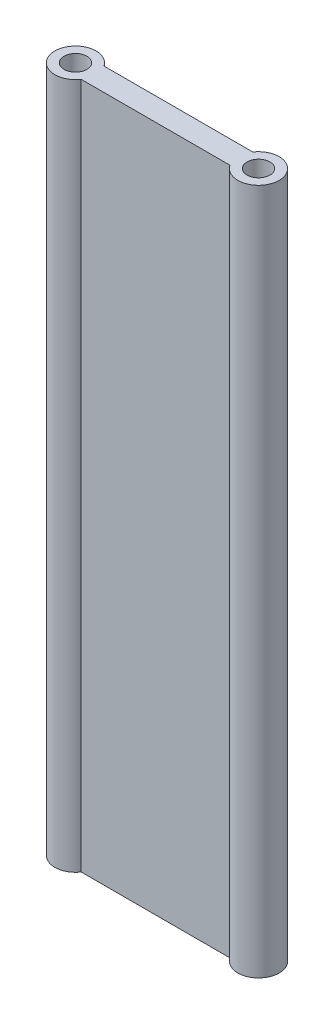
ISO-10303-21;
HEADER;
FILE_DESCRIPTION(('STEP AP214'),'2;1');
FILE_NAME('part.step','',(''),(''),'','','');
FILE_SCHEMA(('AUTOMOTIVE_DESIGN { 1 0 10303 214 1 1 1 1 }'));
ENDSEC;
DATA;
#1=APPLICATION_CONTEXT('core data for automotive mechanical design processes');
#2=APPLICATION_PROTOCOL_DEFINITION('international standard','automotive_design',2000,#1);
#3=PRODUCT_CONTEXT('',#1,'mechanical');
#4=PRODUCT('Part','Part','',(#3));
#5=PRODUCT_RELATED_PRODUCT_CATEGORY('part','',(#4));
#6=PRODUCT_DEFINITION_FORMATION('','',#4);
#7=PRODUCT_DEFINITION_CONTEXT('part definition',#1,'design');
#8=PRODUCT_DEFINITION('design','',#6,#7);
#9=PRODUCT_DEFINITION_SHAPE('','',#8);
#10=(LENGTH_UNIT() NAMED_UNIT(*) SI_UNIT(.MILLI.,.METRE.));
#11=(NAMED_UNIT(*) PLANE_ANGLE_UNIT() SI_UNIT($,.RADIAN.));
#12=(NAMED_UNIT(*) SI_UNIT($,.STERADIAN.) SOLID_ANGLE_UNIT());
#13=UNCERTAINTY_MEASURE_WITH_UNIT(LENGTH_MEASURE(1.E-05),#10,'distance_accuracy_value','');
#14=(GEOMETRIC_REPRESENTATION_CONTEXT(3) GLOBAL_UNCERTAINTY_ASSIGNED_CONTEXT((#13)) GLOBAL_UNIT_ASSIGNED_CONTEXT((#10,
#11,#12)) REPRESENTATION_CONTEXT('',''));
#15=CARTESIAN_POINT('',(0.,0.,0.));
#16=DIRECTION('',(0.,0.,1.));
#17=DIRECTION('',(1.,0.,0.));
#18=AXIS2_PLACEMENT_3D('',#15,#16,#17);
#19=CARTESIAN_POINT('',(25.4,95.25,0.));
#20=DIRECTION('',(0.,-1.,0.));
#21=DIRECTION('',(0.,0.,-1.));
#22=AXIS2_PLACEMENT_3D('',#19,#20,#21);
#23=CYLINDRICAL_SURFACE('',#22,5.71499999999999);
#24=CARTESIAN_POINT('',(25.4,-95.25,0.));
#25=DIRECTION('',(0.,1.,0.));
#26=DIRECTION('',(0.,0.,1.));
#27=AXIS2_PLACEMENT_3D('',#24,#25,#26);
#28=CIRCLE('',#27,5.71499999999999);
#29=CARTESIAN_POINT('',(20.6480951187971,-95.25,3.17499999999999));
#30=VERTEX_POINT('',#29);
#31=CARTESIAN_POINT('',(20.6480951187971,-95.25,-3.175));
#32=VERTEX_POINT('',#31);
#33=EDGE_CURVE('E126',#30,#32,#28,.T.);
#34=ORIENTED_EDGE('',*,*,#33,.T.);
#35=DIRECTION('',(0.,-1.,0.));
#36=VECTOR('',#35,1.);
#37=CARTESIAN_POINT('',(20.6480951187971,95.25,-3.175));
#38=LINE('',#37,#36);
#39=CARTESIAN_POINT('',(20.6480951187971,95.25,-3.175));
#40=VERTEX_POINT('',#39);
#41=EDGE_CURVE('E11',#40,#32,#38,.T.);
#42=ORIENTED_EDGE('',*,*,#41,.F.);
#43=CARTESIAN_POINT('',(25.4,95.25,0.));
#44=DIRECTION('',(0.,1.,0.));
#45=DIRECTION('',(0.,0.,1.));
#46=AXIS2_PLACEMENT_3D('',#43,#44,#45);
#47=CIRCLE('',#46,5.71499999999999);
#48=CARTESIAN_POINT('',(20.6480951187971,95.25,3.17499999999999));
#49=VERTEX_POINT('',#48);
#50=EDGE_CURVE('E90',#49,#40,#47,.T.);
#51=ORIENTED_EDGE('',*,*,#50,.F.);
#52=DIRECTION('',(0.,-1.,0.));
#53=VECTOR('',#52,1.);
#54=CARTESIAN_POINT('',(20.6480951187971,95.25,3.17499999999999));
#55=LINE('',#54,#53);
#56=EDGE_CURVE('E125',#49,#30,#55,.T.);
#57=ORIENTED_EDGE('',*,*,#56,.T.);
#58=EDGE_LOOP('',(#34,#42,#51,#57));
#59=FACE_BOUND('',#58,.T.);
#60=ADVANCED_FACE('F47',(#59),#23,.T.);
#61=CARTESIAN_POINT('',(0.,95.25,-3.17499999999999));
#62=DIRECTION('',(0.,0.,-1.));
#63=DIRECTION('',(-1.,0.,0.));
#64=AXIS2_PLACEMENT_3D('',#61,#62,#63);
#65=PLANE('',#64);
#66=DIRECTION('',(1.,0.,0.));
#67=VECTOR('',#66,1.);
#68=CARTESIAN_POINT('',(0.,-95.25,-3.17499999999999));
#69=LINE('',#68,#67);
#70=CARTESIAN_POINT('',(-20.6480951187971,-95.25,-3.17499999999999));
#71=VERTEX_POINT('',#70);
#72=EDGE_CURVE('E100',#71,#32,#69,.T.);
#73=ORIENTED_EDGE('',*,*,#72,.F.);
#74=DIRECTION('',(0.,-1.,0.));
#75=VECTOR('',#74,1.);
#76=CARTESIAN_POINT('',(-20.6480951187971,95.25,-3.17499999999999));
#77=LINE('',#76,#75);
#78=CARTESIAN_POINT('',(-20.6480951187971,95.25,-3.17499999999999));
#79=VERTEX_POINT('',#78);
#80=EDGE_CURVE('E56',#79,#71,#77,.T.);
#81=ORIENTED_EDGE('',*,*,#80,.F.);
#82=DIRECTION('',(1.,0.,0.));
#83=VECTOR('',#82,1.);
#84=CARTESIAN_POINT('',(0.,95.25,-3.17499999999999));
#85=LINE('',#84,#83);
#86=EDGE_CURVE('E98',#79,#40,#85,.T.);
#87=ORIENTED_EDGE('',*,*,#86,.T.);
#88=ORIENTED_EDGE('',*,*,#41,.T.);
#89=EDGE_LOOP('',(#73,#81,#87,#88));
#90=FACE_BOUND('',#89,.T.);
#91=ADVANCED_FACE('F97',(#90),#65,.T.);
#92=CARTESIAN_POINT('',(-25.4,95.25,0.));
#93=DIRECTION('',(0.,-1.,0.));
#94=DIRECTION('',(0.,0.,-1.));
#95=AXIS2_PLACEMENT_3D('',#92,#93,#94);
#96=CYLINDRICAL_SURFACE('',#95,5.715);
#97=CARTESIAN_POINT('',(-25.4,-95.25,0.));
#98=DIRECTION('',(0.,1.,0.));
#99=DIRECTION('',(0.,0.,1.));
#100=AXIS2_PLACEMENT_3D('',#97,#98,#99);
#101=CIRCLE('',#100,5.715);
#102=CARTESIAN_POINT('',(-20.6480951187971,-95.25,3.175));
#103=VERTEX_POINT('',#102);
#104=EDGE_CURVE('E79',#71,#103,#101,.T.);
#105=ORIENTED_EDGE('',*,*,#104,.T.);
#106=DIRECTION('',(0.,-1.,0.));
#107=VECTOR('',#106,1.);
#108=CARTESIAN_POINT('',(-20.6480951187971,95.25,3.175));
#109=LINE('',#108,#107);
#110=CARTESIAN_POINT('',(-20.6480951187971,95.25,3.175));
#111=VERTEX_POINT('',#110);
#112=EDGE_CURVE('E102',#111,#103,#109,.T.);
#113=ORIENTED_EDGE('',*,*,#112,.F.);
#114=CARTESIAN_POINT('',(-25.4,95.25,0.));
#115=DIRECTION('',(0.,1.,0.));
#116=DIRECTION('',(0.,0.,1.));
#117=AXIS2_PLACEMENT_3D('',#114,#115,#116);
#118=CIRCLE('',#117,5.715);
#119=EDGE_CURVE('E103',#79,#111,#118,.T.);
#120=ORIENTED_EDGE('',*,*,#119,.F.);
#121=ORIENTED_EDGE('',*,*,#80,.T.);
#122=EDGE_LOOP('',(#105,#113,#120,#121));
#123=FACE_BOUND('',#122,.T.);
#124=ADVANCED_FACE('F104',(#123),#96,.T.);
#125=CARTESIAN_POINT('',(25.4,95.25,0.));
#126=DIRECTION('',(0.,-1.,0.));
#127=DIRECTION('',(0.,0.,-1.));
#128=AXIS2_PLACEMENT_3D('',#125,#126,#127);
#129=CYLINDRICAL_SURFACE('',#128,3.175);
#130=CARTESIAN_POINT('',(25.4,95.25,0.));
#131=DIRECTION('',(0.,1.,0.));
#132=DIRECTION('',(0.,0.,1.));
#133=AXIS2_PLACEMENT_3D('',#130,#131,#132);
#134=CIRCLE('',#133,3.175);
#135=CARTESIAN_POINT('',(25.4,95.25,3.175));
#136=VERTEX_POINT('',#135);
#137=EDGE_CURVE('E117',#136,#136,#134,.T.);
#138=ORIENTED_EDGE('',*,*,#137,.T.);
#139=EDGE_LOOP('',(#138));
#140=FACE_BOUND('',#139,.T.);
#141=CARTESIAN_POINT('',(25.4,-95.25,0.));
#142=DIRECTION('',(0.,1.,0.));
#143=DIRECTION('',(0.,0.,1.));
#144=AXIS2_PLACEMENT_3D('',#141,#142,#143);
#145=CIRCLE('',#144,3.175);
#146=CARTESIAN_POINT('',(25.4,-95.25,3.175));
#147=VERTEX_POINT('',#146);
#148=EDGE_CURVE('E136',#147,#147,#145,.T.);
#149=ORIENTED_EDGE('',*,*,#148,.F.);
#150=EDGE_LOOP('',(#149));
#151=FACE_BOUND('',#150,.T.);
#152=ADVANCED_FACE('F159',(#140,#151),#129,.F.);
#153=CARTESIAN_POINT('',(0.,95.25,3.17499999999999));
#154=DIRECTION('',(0.,0.,-1.));
#155=DIRECTION('',(-1.,0.,0.));
#156=AXIS2_PLACEMENT_3D('',#153,#154,#155);
#157=PLANE('',#156);
#158=DIRECTION('',(1.,0.,0.));
#159=VECTOR('',#158,1.);
#160=CARTESIAN_POINT('',(0.,-95.25,3.17499999999999));
#161=LINE('',#160,#159);
#162=EDGE_CURVE('E85',#103,#30,#161,.T.);
#163=ORIENTED_EDGE('',*,*,#162,.T.);
#164=ORIENTED_EDGE('',*,*,#56,.F.);
#165=DIRECTION('',(1.,0.,0.));
#166=VECTOR('',#165,1.);
#167=CARTESIAN_POINT('',(0.,95.25,3.17499999999999));
#168=LINE('',#167,#166);
#169=EDGE_CURVE('E64',#111,#49,#168,.T.);
#170=ORIENTED_EDGE('',*,*,#169,.F.);
#171=ORIENTED_EDGE('',*,*,#112,.T.);
#172=EDGE_LOOP('',(#163,#164,#170,#171));
#173=FACE_BOUND('',#172,.T.);
#174=ADVANCED_FACE('F146',(#173),#157,.F.);
#175=CARTESIAN_POINT('',(-25.4,95.25,0.));
#176=DIRECTION('',(0.,-1.,0.));
#177=DIRECTION('',(0.,0.,-1.));
#178=AXIS2_PLACEMENT_3D('',#175,#176,#177);
#179=CYLINDRICAL_SURFACE('',#178,3.175);
#180=CARTESIAN_POINT('',(-25.4,95.25,0.));
#181=DIRECTION('',(0.,1.,0.));
#182=DIRECTION('',(0.,0.,1.));
#183=AXIS2_PLACEMENT_3D('',#180,#181,#182);
#184=CIRCLE('',#183,3.175);
#185=CARTESIAN_POINT('',(-25.4,95.25,3.175));
#186=VERTEX_POINT('',#185);
#187=EDGE_CURVE('E121',#186,#186,#184,.T.);
#188=ORIENTED_EDGE('',*,*,#187,.T.);
#189=EDGE_LOOP('',(#188));
#190=FACE_BOUND('',#189,.T.);
#191=CARTESIAN_POINT('',(-25.4,-95.25,0.));
#192=DIRECTION('',(0.,1.,0.));
#193=DIRECTION('',(0.,0.,1.));
#194=AXIS2_PLACEMENT_3D('',#191,#192,#193);
#195=CIRCLE('',#194,3.175);
#196=CARTESIAN_POINT('',(-25.4,-95.25,3.175));
#197=VERTEX_POINT('',#196);
#198=EDGE_CURVE('E112',#197,#197,#195,.T.);
#199=ORIENTED_EDGE('',*,*,#198,.F.);
#200=EDGE_LOOP('',(#199));
#201=FACE_BOUND('',#200,.T.);
#202=ADVANCED_FACE('F164',(#190,#201),#179,.F.);
#203=CARTESIAN_POINT('',(0.,95.25,0.));
#204=DIRECTION('',(0.,1.,0.));
#205=DIRECTION('',(0.,0.,1.));
#206=AXIS2_PLACEMENT_3D('',#203,#204,#205);
#207=PLANE('',#206);
#208=ORIENTED_EDGE('',*,*,#50,.T.);
#209=ORIENTED_EDGE('',*,*,#86,.F.);
#210=ORIENTED_EDGE('',*,*,#119,.T.);
#211=ORIENTED_EDGE('',*,*,#169,.T.);
#212=EDGE_LOOP('',(#208,#209,#210,#211));
#213=FACE_BOUND('',#212,.T.);
#214=ORIENTED_EDGE('',*,*,#137,.F.);
#215=EDGE_LOOP('',(#214));
#216=FACE_BOUND('',#215,.T.);
#217=ORIENTED_EDGE('',*,*,#187,.F.);
#218=EDGE_LOOP('',(#217));
#219=FACE_BOUND('',#218,.T.);
#220=ADVANCED_FACE('F107',(#213,#216,#219),#207,.T.);
#221=CARTESIAN_POINT('',(0.,-95.25,0.));
#222=DIRECTION('',(0.,1.,0.));
#223=DIRECTION('',(0.,0.,1.));
#224=AXIS2_PLACEMENT_3D('',#221,#222,#223);
#225=PLANE('',#224);
#226=ORIENTED_EDGE('',*,*,#33,.F.);
#227=ORIENTED_EDGE('',*,*,#162,.F.);
#228=ORIENTED_EDGE('',*,*,#104,.F.);
#229=ORIENTED_EDGE('',*,*,#72,.T.);
#230=EDGE_LOOP('',(#226,#227,#228,#229));
#231=FACE_BOUND('',#230,.T.);
#232=ORIENTED_EDGE('',*,*,#148,.T.);
#233=EDGE_LOOP('',(#232));
#234=FACE_BOUND('',#233,.T.);
#235=ORIENTED_EDGE('',*,*,#198,.T.);
#236=EDGE_LOOP('',(#235));
#237=FACE_BOUND('',#236,.T.);
#238=ADVANCED_FACE('F149',(#231,#234,#237),#225,.F.);
#239=CLOSED_SHELL('',(#60,#91,#124,#152,#174,#202,#220,#238));
#240=MANIFOLD_SOLID_BREP('B2',#239);
#241=ADVANCED_BREP_SHAPE_REPRESENTATION('',(#18,#240),#14);
#242=SHAPE_DEFINITION_REPRESENTATION(#9,#241);
ENDSEC;
END-ISO-10303-21;
